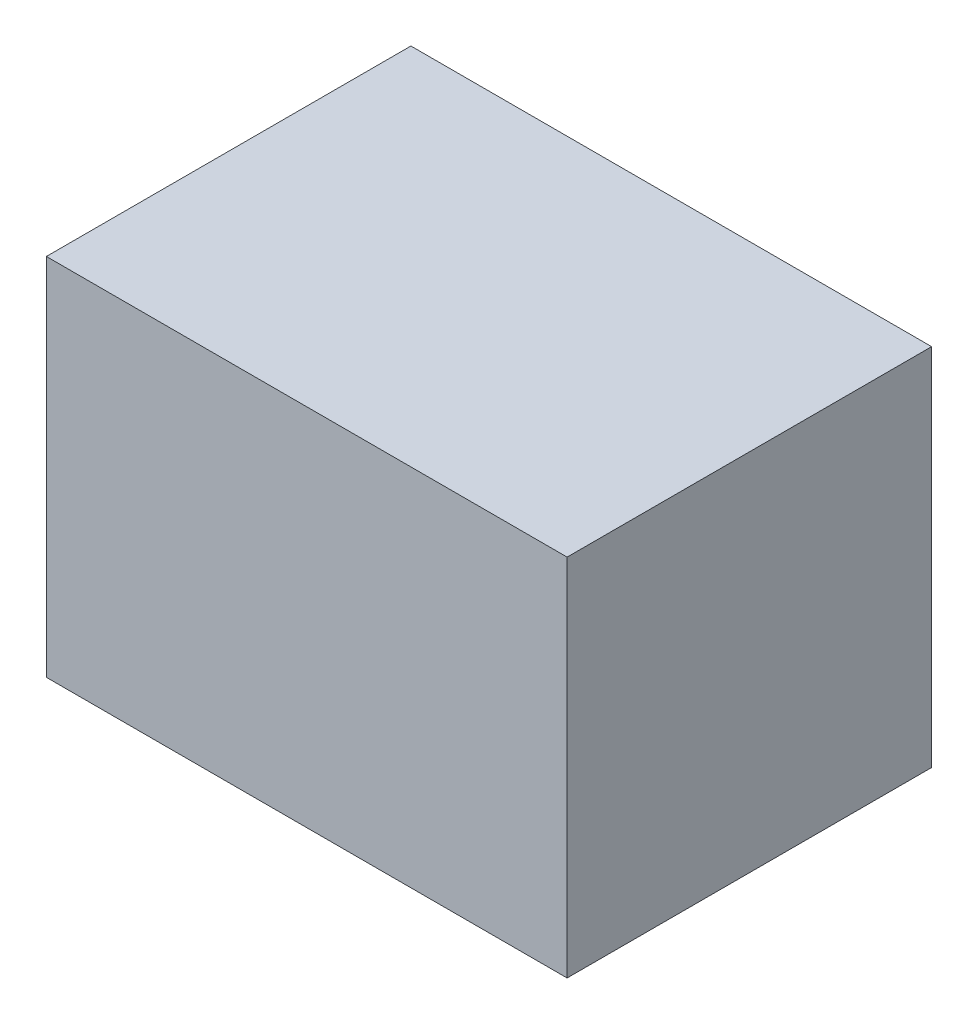
ISO-10303-21;
HEADER;
FILE_DESCRIPTION(('STEP AP214'),'2;1');
FILE_NAME('part.step','',(''),(''),'','','');
FILE_SCHEMA(('AUTOMOTIVE_DESIGN { 1 0 10303 214 1 1 1 1 }'));
ENDSEC;
DATA;
#1=APPLICATION_CONTEXT('core data for automotive mechanical design processes');
#2=APPLICATION_PROTOCOL_DEFINITION('international standard','automotive_design',2000,#1);
#3=PRODUCT_CONTEXT('',#1,'mechanical');
#4=PRODUCT('Part','Part','',(#3));
#5=PRODUCT_RELATED_PRODUCT_CATEGORY('part','',(#4));
#6=PRODUCT_DEFINITION_FORMATION('','',#4);
#7=PRODUCT_DEFINITION_CONTEXT('part definition',#1,'design');
#8=PRODUCT_DEFINITION('design','',#6,#7);
#9=PRODUCT_DEFINITION_SHAPE('','',#8);
#10=(LENGTH_UNIT() NAMED_UNIT(*) SI_UNIT(.MILLI.,.METRE.));
#11=(NAMED_UNIT(*) PLANE_ANGLE_UNIT() SI_UNIT($,.RADIAN.));
#12=(NAMED_UNIT(*) SI_UNIT($,.STERADIAN.) SOLID_ANGLE_UNIT());
#13=UNCERTAINTY_MEASURE_WITH_UNIT(LENGTH_MEASURE(1.E-05),#10,'distance_accuracy_value','');
#14=(GEOMETRIC_REPRESENTATION_CONTEXT(3) GLOBAL_UNCERTAINTY_ASSIGNED_CONTEXT((#13)) GLOBAL_UNIT_ASSIGNED_CONTEXT((#10,
#11,#12)) REPRESENTATION_CONTEXT('',''));
#15=CARTESIAN_POINT('',(0.,0.,0.));
#16=DIRECTION('',(0.,0.,1.));
#17=DIRECTION('',(1.,0.,0.));
#18=AXIS2_PLACEMENT_3D('',#15,#16,#17);
#19=CARTESIAN_POINT('',(-27.94,0.,0.));
#20=DIRECTION('',(0.,1.,0.));
#21=DIRECTION('',(1.,0.,0.));
#22=AXIS2_PLACEMENT_3D('',#19,#20,#21);
#23=PLANE('',#22);
#24=DIRECTION('',(0.,0.,1.));
#25=VECTOR('',#24,1.);
#26=CARTESIAN_POINT('',(-12.95,0.,0.749999999999982));
#27=LINE('',#26,#25);
#28=CARTESIAN_POINT('',(-12.95,0.,0.749999999999982));
#29=VERTEX_POINT('',#28);
#30=CARTESIAN_POINT('',(-12.95,0.,1.1));
#31=VERTEX_POINT('',#30);
#32=EDGE_CURVE('E68',#29,#31,#27,.T.);
#33=ORIENTED_EDGE('',*,*,#32,.T.);
#34=DIRECTION('',(1.,0.,0.));
#35=VECTOR('',#34,1.);
#36=CARTESIAN_POINT('',(-12.95,0.,1.1));
#37=LINE('',#36,#35);
#38=CARTESIAN_POINT('',(-12.45,0.,1.1));
#39=VERTEX_POINT('',#38);
#40=EDGE_CURVE('E28',#31,#39,#37,.T.);
#41=ORIENTED_EDGE('',*,*,#40,.T.);
#42=DIRECTION('',(0.,0.,1.));
#43=VECTOR('',#42,1.);
#44=CARTESIAN_POINT('',(-12.45,0.,0.749999999999982));
#45=LINE('',#44,#43);
#46=CARTESIAN_POINT('',(-12.45,0.,0.749999999999982));
#47=VERTEX_POINT('',#46);
#48=EDGE_CURVE('E70',#47,#39,#45,.T.);
#49=ORIENTED_EDGE('',*,*,#48,.F.);
#50=DIRECTION('',(1.,0.,0.));
#51=VECTOR('',#50,1.);
#52=CARTESIAN_POINT('',(-12.95,0.,0.749999999999982));
#53=LINE('',#52,#51);
#54=EDGE_CURVE('E21',#29,#47,#53,.T.);
#55=ORIENTED_EDGE('',*,*,#54,.F.);
#56=EDGE_LOOP('',(#33,#41,#49,#55));
#57=FACE_BOUND('',#56,.T.);
#58=ADVANCED_FACE('F17',(#57),#23,.T.);
#59=CARTESIAN_POINT('',(-27.94,-0.35,0.));
#60=DIRECTION('',(0.,1.,0.));
#61=DIRECTION('',(1.,0.,0.));
#62=AXIS2_PLACEMENT_3D('',#59,#60,#61);
#63=PLANE('',#62);
#64=DIRECTION('',(0.,0.,1.));
#65=VECTOR('',#64,1.);
#66=CARTESIAN_POINT('',(-12.95,-0.35,0.749999999999982));
#67=LINE('',#66,#65);
#68=CARTESIAN_POINT('',(-12.95,-0.35,0.749999999999982));
#69=VERTEX_POINT('',#68);
#70=CARTESIAN_POINT('',(-12.95,-0.35,1.1));
#71=VERTEX_POINT('',#70);
#72=EDGE_CURVE('E87',#69,#71,#67,.T.);
#73=ORIENTED_EDGE('',*,*,#72,.F.);
#74=DIRECTION('',(1.,0.,0.));
#75=VECTOR('',#74,1.);
#76=CARTESIAN_POINT('',(-12.95,-0.35,0.749999999999982));
#77=LINE('',#76,#75);
#78=CARTESIAN_POINT('',(-12.45,-0.35,0.749999999999982));
#79=VERTEX_POINT('',#78);
#80=EDGE_CURVE('E82',#69,#79,#77,.T.);
#81=ORIENTED_EDGE('',*,*,#80,.T.);
#82=DIRECTION('',(0.,0.,1.));
#83=VECTOR('',#82,1.);
#84=CARTESIAN_POINT('',(-12.45,-0.35,0.749999999999982));
#85=LINE('',#84,#83);
#86=CARTESIAN_POINT('',(-12.45,-0.35,1.1));
#87=VERTEX_POINT('',#86);
#88=EDGE_CURVE('E99',#79,#87,#85,.T.);
#89=ORIENTED_EDGE('',*,*,#88,.T.);
#90=DIRECTION('',(1.,0.,0.));
#91=VECTOR('',#90,1.);
#92=CARTESIAN_POINT('',(-12.95,-0.35,1.1));
#93=LINE('',#92,#91);
#94=EDGE_CURVE('E11',#71,#87,#93,.T.);
#95=ORIENTED_EDGE('',*,*,#94,.F.);
#96=EDGE_LOOP('',(#73,#81,#89,#95));
#97=FACE_BOUND('',#96,.T.);
#98=ADVANCED_FACE('F153',(#97),#63,.F.);
#99=CARTESIAN_POINT('',(-12.95,-0.35,1.1));
#100=DIRECTION('',(0.,0.,1.));
#101=DIRECTION('',(1.,0.,0.));
#102=AXIS2_PLACEMENT_3D('',#99,#100,#101);
#103=PLANE('',#102);
#104=ORIENTED_EDGE('',*,*,#40,.F.);
#105=DIRECTION('',(0.,1.,0.));
#106=VECTOR('',#105,1.);
#107=CARTESIAN_POINT('',(-12.95,-0.35,1.1));
#108=LINE('',#107,#106);
#109=EDGE_CURVE('E76',#71,#31,#108,.T.);
#110=ORIENTED_EDGE('',*,*,#109,.F.);
#111=ORIENTED_EDGE('',*,*,#94,.T.);
#112=DIRECTION('',(0.,1.,0.));
#113=VECTOR('',#112,1.);
#114=CARTESIAN_POINT('',(-12.45,-0.35,1.1));
#115=LINE('',#114,#113);
#116=EDGE_CURVE('E101',#87,#39,#115,.T.);
#117=ORIENTED_EDGE('',*,*,#116,.T.);
#118=EDGE_LOOP('',(#104,#110,#111,#117));
#119=FACE_BOUND('',#118,.T.);
#120=ADVANCED_FACE('F114',(#119),#103,.T.);
#121=CARTESIAN_POINT('',(-12.45,-0.35,0.749999999999982));
#122=DIRECTION('',(-1.,0.,0.));
#123=DIRECTION('',(0.,0.,1.));
#124=AXIS2_PLACEMENT_3D('',#121,#122,#123);
#125=PLANE('',#124);
#126=ORIENTED_EDGE('',*,*,#48,.T.);
#127=ORIENTED_EDGE('',*,*,#116,.F.);
#128=ORIENTED_EDGE('',*,*,#88,.F.);
#129=DIRECTION('',(0.,1.,0.));
#130=VECTOR('',#129,1.);
#131=CARTESIAN_POINT('',(-12.45,-0.35,0.749999999999982));
#132=LINE('',#131,#130);
#133=EDGE_CURVE('E75',#79,#47,#132,.T.);
#134=ORIENTED_EDGE('',*,*,#133,.T.);
#135=EDGE_LOOP('',(#126,#127,#128,#134));
#136=FACE_BOUND('',#135,.T.);
#137=ADVANCED_FACE('F19',(#136),#125,.F.);
#138=CARTESIAN_POINT('',(-12.95,-0.35,0.749999999999982));
#139=DIRECTION('',(0.,0.,1.));
#140=DIRECTION('',(1.,0.,0.));
#141=AXIS2_PLACEMENT_3D('',#138,#139,#140);
#142=PLANE('',#141);
#143=ORIENTED_EDGE('',*,*,#54,.T.);
#144=ORIENTED_EDGE('',*,*,#133,.F.);
#145=ORIENTED_EDGE('',*,*,#80,.F.);
#146=DIRECTION('',(0.,1.,0.));
#147=VECTOR('',#146,1.);
#148=CARTESIAN_POINT('',(-12.95,-0.35,0.749999999999982));
#149=LINE('',#148,#147);
#150=EDGE_CURVE('E79',#69,#29,#149,.T.);
#151=ORIENTED_EDGE('',*,*,#150,.T.);
#152=EDGE_LOOP('',(#143,#144,#145,#151));
#153=FACE_BOUND('',#152,.T.);
#154=ADVANCED_FACE('F80',(#153),#142,.F.);
#155=CARTESIAN_POINT('',(-12.95,-0.35,0.749999999999982));
#156=DIRECTION('',(-1.,0.,0.));
#157=DIRECTION('',(0.,0.,1.));
#158=AXIS2_PLACEMENT_3D('',#155,#156,#157);
#159=PLANE('',#158);
#160=ORIENTED_EDGE('',*,*,#32,.F.);
#161=ORIENTED_EDGE('',*,*,#150,.F.);
#162=ORIENTED_EDGE('',*,*,#72,.T.);
#163=ORIENTED_EDGE('',*,*,#109,.T.);
#164=EDGE_LOOP('',(#160,#161,#162,#163));
#165=FACE_BOUND('',#164,.T.);
#166=ADVANCED_FACE('F89',(#165),#159,.T.);
#167=CLOSED_SHELL('',(#58,#98,#120,#137,#154,#166));
#168=MANIFOLD_SOLID_BREP('B1',#167);
#169=ADVANCED_BREP_SHAPE_REPRESENTATION('',(#18,#168),#14);
#170=SHAPE_DEFINITION_REPRESENTATION(#9,#169);
ENDSEC;
END-ISO-10303-21;
